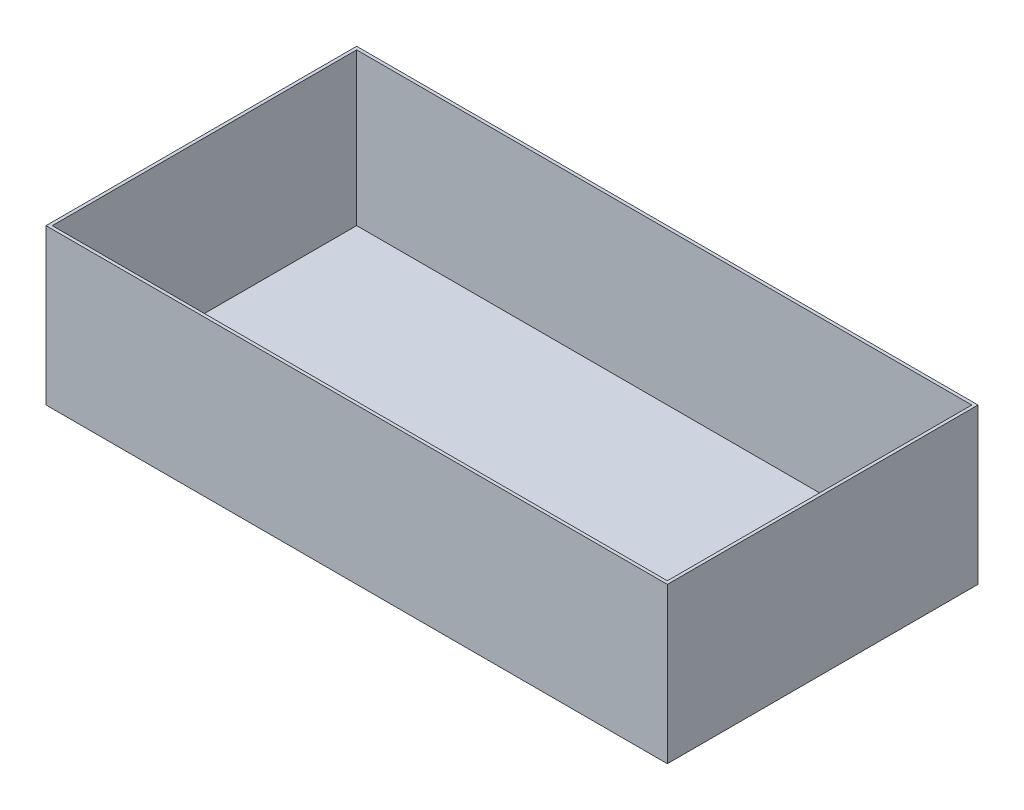
ISO-10303-21;
HEADER;
FILE_DESCRIPTION(('STEP AP214'),'2;1');
FILE_NAME('part.step','',(''),(''),'','','');
FILE_SCHEMA(('AUTOMOTIVE_DESIGN { 1 0 10303 214 1 1 1 1 }'));
ENDSEC;
DATA;
#1=APPLICATION_CONTEXT('core data for automotive mechanical design processes');
#2=APPLICATION_PROTOCOL_DEFINITION('international standard','automotive_design',2000,#1);
#3=PRODUCT_CONTEXT('',#1,'mechanical');
#4=PRODUCT('Part','Part','',(#3));
#5=PRODUCT_RELATED_PRODUCT_CATEGORY('part','',(#4));
#6=PRODUCT_DEFINITION_FORMATION('','',#4);
#7=PRODUCT_DEFINITION_CONTEXT('part definition',#1,'design');
#8=PRODUCT_DEFINITION('design','',#6,#7);
#9=PRODUCT_DEFINITION_SHAPE('','',#8);
#10=(LENGTH_UNIT() NAMED_UNIT(*) SI_UNIT(.MILLI.,.METRE.));
#11=(NAMED_UNIT(*) PLANE_ANGLE_UNIT() SI_UNIT($,.RADIAN.));
#12=(NAMED_UNIT(*) SI_UNIT($,.STERADIAN.) SOLID_ANGLE_UNIT());
#13=UNCERTAINTY_MEASURE_WITH_UNIT(LENGTH_MEASURE(1.E-05),#10,'distance_accuracy_value','');
#14=(GEOMETRIC_REPRESENTATION_CONTEXT(3) GLOBAL_UNCERTAINTY_ASSIGNED_CONTEXT((#13)) GLOBAL_UNIT_ASSIGNED_CONTEXT((#10,
#11,#12)) REPRESENTATION_CONTEXT('',''));
#15=CARTESIAN_POINT('',(0.,0.,0.));
#16=DIRECTION('',(0.,0.,1.));
#17=DIRECTION('',(1.,0.,0.));
#18=AXIS2_PLACEMENT_3D('',#15,#16,#17);
#19=CARTESIAN_POINT('',(-100.,50.,50.));
#20=DIRECTION('',(-1.,0.,0.));
#21=DIRECTION('',(0.,0.,1.));
#22=AXIS2_PLACEMENT_3D('',#19,#20,#21);
#23=PLANE('',#22);
#24=DIRECTION('',(0.,0.,-1.));
#25=VECTOR('',#24,1.);
#26=CARTESIAN_POINT('',(-100.,0.,50.));
#27=LINE('',#26,#25);
#28=CARTESIAN_POINT('',(-100.,0.,50.));
#29=VERTEX_POINT('',#28);
#30=CARTESIAN_POINT('',(-100.,0.,-50.));
#31=VERTEX_POINT('',#30);
#32=EDGE_CURVE('E139',#29,#31,#27,.T.);
#33=ORIENTED_EDGE('',*,*,#32,.F.);
#34=DIRECTION('',(0.,-1.,0.));
#35=VECTOR('',#34,1.);
#36=CARTESIAN_POINT('',(-100.,50.,50.));
#37=LINE('',#36,#35);
#38=CARTESIAN_POINT('',(-100.,50.,50.));
#39=VERTEX_POINT('',#38);
#40=EDGE_CURVE('E11',#39,#29,#37,.T.);
#41=ORIENTED_EDGE('',*,*,#40,.F.);
#42=DIRECTION('',(0.,0.,-1.));
#43=VECTOR('',#42,1.);
#44=CARTESIAN_POINT('',(-100.,50.,50.));
#45=LINE('',#44,#43);
#46=CARTESIAN_POINT('',(-100.,50.,-50.));
#47=VERTEX_POINT('',#46);
#48=EDGE_CURVE('E143',#39,#47,#45,.T.);
#49=ORIENTED_EDGE('',*,*,#48,.T.);
#50=DIRECTION('',(0.,-1.,0.));
#51=VECTOR('',#50,1.);
#52=CARTESIAN_POINT('',(-100.,50.,-50.));
#53=LINE('',#52,#51);
#54=EDGE_CURVE('E36',#47,#31,#53,.T.);
#55=ORIENTED_EDGE('',*,*,#54,.T.);
#56=EDGE_LOOP('',(#33,#41,#49,#55));
#57=FACE_BOUND('',#56,.T.);
#58=ADVANCED_FACE('F33',(#57),#23,.T.);
#59=CARTESIAN_POINT('',(-100.,50.,50.));
#60=DIRECTION('',(0.,0.,-1.));
#61=DIRECTION('',(-1.,0.,0.));
#62=AXIS2_PLACEMENT_3D('',#59,#60,#61);
#63=PLANE('',#62);
#64=DIRECTION('',(1.,0.,0.));
#65=VECTOR('',#64,1.);
#66=CARTESIAN_POINT('',(-100.,0.,50.));
#67=LINE('',#66,#65);
#68=CARTESIAN_POINT('',(100.,0.,50.));
#69=VERTEX_POINT('',#68);
#70=EDGE_CURVE('E146',#29,#69,#67,.T.);
#71=ORIENTED_EDGE('',*,*,#70,.T.);
#72=DIRECTION('',(0.,-1.,0.));
#73=VECTOR('',#72,1.);
#74=CARTESIAN_POINT('',(100.,50.,50.));
#75=LINE('',#74,#73);
#76=CARTESIAN_POINT('',(100.,50.,50.));
#77=VERTEX_POINT('',#76);
#78=EDGE_CURVE('E41',#77,#69,#75,.T.);
#79=ORIENTED_EDGE('',*,*,#78,.F.);
#80=DIRECTION('',(1.,0.,0.));
#81=VECTOR('',#80,1.);
#82=CARTESIAN_POINT('',(-100.,50.,50.));
#83=LINE('',#82,#81);
#84=EDGE_CURVE('E150',#39,#77,#83,.T.);
#85=ORIENTED_EDGE('',*,*,#84,.F.);
#86=ORIENTED_EDGE('',*,*,#40,.T.);
#87=EDGE_LOOP('',(#71,#79,#85,#86));
#88=FACE_BOUND('',#87,.T.);
#89=ADVANCED_FACE('F170',(#88),#63,.F.);
#90=CARTESIAN_POINT('',(100.,50.,50.));
#91=DIRECTION('',(-1.,0.,0.));
#92=DIRECTION('',(0.,0.,1.));
#93=AXIS2_PLACEMENT_3D('',#90,#91,#92);
#94=PLANE('',#93);
#95=DIRECTION('',(0.,0.,-1.));
#96=VECTOR('',#95,1.);
#97=CARTESIAN_POINT('',(100.,0.,50.));
#98=LINE('',#97,#96);
#99=CARTESIAN_POINT('',(100.,0.,-50.));
#100=VERTEX_POINT('',#99);
#101=EDGE_CURVE('E157',#69,#100,#98,.T.);
#102=ORIENTED_EDGE('',*,*,#101,.T.);
#103=DIRECTION('',(0.,-1.,0.));
#104=VECTOR('',#103,1.);
#105=CARTESIAN_POINT('',(100.,50.,-50.));
#106=LINE('',#105,#104);
#107=CARTESIAN_POINT('',(100.,50.,-50.));
#108=VERTEX_POINT('',#107);
#109=EDGE_CURVE('E162',#108,#100,#106,.T.);
#110=ORIENTED_EDGE('',*,*,#109,.F.);
#111=DIRECTION('',(0.,0.,-1.));
#112=VECTOR('',#111,1.);
#113=CARTESIAN_POINT('',(100.,50.,50.));
#114=LINE('',#113,#112);
#115=EDGE_CURVE('E148',#77,#108,#114,.T.);
#116=ORIENTED_EDGE('',*,*,#115,.F.);
#117=ORIENTED_EDGE('',*,*,#78,.T.);
#118=EDGE_LOOP('',(#102,#110,#116,#117));
#119=FACE_BOUND('',#118,.T.);
#120=ADVANCED_FACE('F173',(#119),#94,.F.);
#121=CARTESIAN_POINT('',(-100.,50.,-50.));
#122=DIRECTION('',(0.,0.,-1.));
#123=DIRECTION('',(-1.,0.,0.));
#124=AXIS2_PLACEMENT_3D('',#121,#122,#123);
#125=PLANE('',#124);
#126=DIRECTION('',(1.,0.,0.));
#127=VECTOR('',#126,1.);
#128=CARTESIAN_POINT('',(-100.,0.,-50.));
#129=LINE('',#128,#127);
#130=EDGE_CURVE('E154',#31,#100,#129,.T.);
#131=ORIENTED_EDGE('',*,*,#130,.F.);
#132=ORIENTED_EDGE('',*,*,#54,.F.);
#133=DIRECTION('',(1.,0.,0.));
#134=VECTOR('',#133,1.);
#135=CARTESIAN_POINT('',(-100.,50.,-50.));
#136=LINE('',#135,#134);
#137=EDGE_CURVE('E145',#47,#108,#136,.T.);
#138=ORIENTED_EDGE('',*,*,#137,.T.);
#139=ORIENTED_EDGE('',*,*,#109,.T.);
#140=EDGE_LOOP('',(#131,#132,#138,#139));
#141=FACE_BOUND('',#140,.T.);
#142=ADVANCED_FACE('F165',(#141),#125,.T.);
#143=CARTESIAN_POINT('',(0.,50.,0.));
#144=DIRECTION('',(0.,-1.,0.));
#145=DIRECTION('',(0.,0.,-1.));
#146=AXIS2_PLACEMENT_3D('',#143,#144,#145);
#147=PLANE('',#146);
#148=DIRECTION('',(-1.,0.,0.));
#149=VECTOR('',#148,1.);
#150=CARTESIAN_POINT('',(-99.,50.,-49.));
#151=LINE('',#150,#149);
#152=CARTESIAN_POINT('',(99.,50.,-49.));
#153=VERTEX_POINT('',#152);
#154=CARTESIAN_POINT('',(-99.,50.,-49.));
#155=VERTEX_POINT('',#154);
#156=EDGE_CURVE('E133',#153,#155,#151,.T.);
#157=ORIENTED_EDGE('',*,*,#156,.F.);
#158=DIRECTION('',(0.,0.,-1.));
#159=VECTOR('',#158,1.);
#160=CARTESIAN_POINT('',(99.,50.,49.));
#161=LINE('',#160,#159);
#162=CARTESIAN_POINT('',(99.,50.,49.));
#163=VERTEX_POINT('',#162);
#164=EDGE_CURVE('E49',#163,#153,#161,.T.);
#165=ORIENTED_EDGE('',*,*,#164,.F.);
#166=DIRECTION('',(1.,0.,0.));
#167=VECTOR('',#166,1.);
#168=CARTESIAN_POINT('',(-99.,50.,49.));
#169=LINE('',#168,#167);
#170=CARTESIAN_POINT('',(-99.,50.,49.));
#171=VERTEX_POINT('',#170);
#172=EDGE_CURVE('E124',#171,#163,#169,.T.);
#173=ORIENTED_EDGE('',*,*,#172,.F.);
#174=DIRECTION('',(0.,0.,1.));
#175=VECTOR('',#174,1.);
#176=CARTESIAN_POINT('',(-99.,50.,49.));
#177=LINE('',#176,#175);
#178=EDGE_CURVE('E127',#155,#171,#177,.T.);
#179=ORIENTED_EDGE('',*,*,#178,.F.);
#180=EDGE_LOOP('',(#157,#165,#173,#179));
#181=FACE_BOUND('',#180,.T.);
#182=ORIENTED_EDGE('',*,*,#48,.F.);
#183=ORIENTED_EDGE('',*,*,#84,.T.);
#184=ORIENTED_EDGE('',*,*,#115,.T.);
#185=ORIENTED_EDGE('',*,*,#137,.F.);
#186=EDGE_LOOP('',(#182,#183,#184,#185));
#187=FACE_BOUND('',#186,.T.);
#188=ADVANCED_FACE('F175',(#181,#187),#147,.F.);
#189=CARTESIAN_POINT('',(0.,0.,0.));
#190=DIRECTION('',(0.,-1.,0.));
#191=DIRECTION('',(0.,0.,-1.));
#192=AXIS2_PLACEMENT_3D('',#189,#190,#191);
#193=PLANE('',#192);
#194=ORIENTED_EDGE('',*,*,#32,.T.);
#195=ORIENTED_EDGE('',*,*,#130,.T.);
#196=ORIENTED_EDGE('',*,*,#101,.F.);
#197=ORIENTED_EDGE('',*,*,#70,.F.);
#198=EDGE_LOOP('',(#194,#195,#196,#197));
#199=FACE_BOUND('',#198,.T.);
#200=ADVANCED_FACE('F168',(#199),#193,.T.);
#201=CARTESIAN_POINT('',(99.,1.,49.));
#202=DIRECTION('',(1.,0.,0.));
#203=DIRECTION('',(0.,0.,-1.));
#204=AXIS2_PLACEMENT_3D('',#201,#202,#203);
#205=PLANE('',#204);
#206=ORIENTED_EDGE('',*,*,#164,.T.);
#207=DIRECTION('',(0.,1.,0.));
#208=VECTOR('',#207,1.);
#209=CARTESIAN_POINT('',(99.,1.,-49.));
#210=LINE('',#209,#208);
#211=CARTESIAN_POINT('',(99.,1.,-49.));
#212=VERTEX_POINT('',#211);
#213=EDGE_CURVE('E102',#212,#153,#210,.T.);
#214=ORIENTED_EDGE('',*,*,#213,.F.);
#215=DIRECTION('',(0.,0.,-1.));
#216=VECTOR('',#215,1.);
#217=CARTESIAN_POINT('',(99.,1.,49.));
#218=LINE('',#217,#216);
#219=CARTESIAN_POINT('',(99.,1.,49.));
#220=VERTEX_POINT('',#219);
#221=EDGE_CURVE('E106',#220,#212,#218,.T.);
#222=ORIENTED_EDGE('',*,*,#221,.F.);
#223=DIRECTION('',(0.,1.,0.));
#224=VECTOR('',#223,1.);
#225=CARTESIAN_POINT('',(99.,1.,49.));
#226=LINE('',#225,#224);
#227=EDGE_CURVE('E137',#220,#163,#226,.T.);
#228=ORIENTED_EDGE('',*,*,#227,.T.);
#229=EDGE_LOOP('',(#206,#214,#222,#228));
#230=FACE_BOUND('',#229,.T.);
#231=ADVANCED_FACE('F104',(#230),#205,.F.);
#232=CARTESIAN_POINT('',(-99.,1.,49.));
#233=DIRECTION('',(0.,0.,1.));
#234=DIRECTION('',(1.,0.,0.));
#235=AXIS2_PLACEMENT_3D('',#232,#233,#234);
#236=PLANE('',#235);
#237=ORIENTED_EDGE('',*,*,#172,.T.);
#238=ORIENTED_EDGE('',*,*,#227,.F.);
#239=DIRECTION('',(1.,0.,0.));
#240=VECTOR('',#239,1.);
#241=CARTESIAN_POINT('',(-99.,1.,49.));
#242=LINE('',#241,#240);
#243=CARTESIAN_POINT('',(-99.,1.,49.));
#244=VERTEX_POINT('',#243);
#245=EDGE_CURVE('E112',#244,#220,#242,.T.);
#246=ORIENTED_EDGE('',*,*,#245,.F.);
#247=DIRECTION('',(0.,1.,0.));
#248=VECTOR('',#247,1.);
#249=CARTESIAN_POINT('',(-99.,1.,49.));
#250=LINE('',#249,#248);
#251=EDGE_CURVE('E140',#244,#171,#250,.T.);
#252=ORIENTED_EDGE('',*,*,#251,.T.);
#253=EDGE_LOOP('',(#237,#238,#246,#252));
#254=FACE_BOUND('',#253,.T.);
#255=ADVANCED_FACE('F219',(#254),#236,.F.);
#256=CARTESIAN_POINT('',(-99.,1.,49.));
#257=DIRECTION('',(-1.,0.,0.));
#258=DIRECTION('',(0.,0.,1.));
#259=AXIS2_PLACEMENT_3D('',#256,#257,#258);
#260=PLANE('',#259);
#261=ORIENTED_EDGE('',*,*,#178,.T.);
#262=ORIENTED_EDGE('',*,*,#251,.F.);
#263=DIRECTION('',(0.,0.,1.));
#264=VECTOR('',#263,1.);
#265=CARTESIAN_POINT('',(-99.,1.,49.));
#266=LINE('',#265,#264);
#267=CARTESIAN_POINT('',(-99.,1.,-49.));
#268=VERTEX_POINT('',#267);
#269=EDGE_CURVE('E120',#268,#244,#266,.T.);
#270=ORIENTED_EDGE('',*,*,#269,.F.);
#271=DIRECTION('',(0.,1.,0.));
#272=VECTOR('',#271,1.);
#273=CARTESIAN_POINT('',(-99.,1.,-49.));
#274=LINE('',#273,#272);
#275=EDGE_CURVE('E111',#268,#155,#274,.T.);
#276=ORIENTED_EDGE('',*,*,#275,.T.);
#277=EDGE_LOOP('',(#261,#262,#270,#276));
#278=FACE_BOUND('',#277,.T.);
#279=ADVANCED_FACE('F227',(#278),#260,.F.);
#280=CARTESIAN_POINT('',(-99.,1.,-49.));
#281=DIRECTION('',(0.,0.,-1.));
#282=DIRECTION('',(-1.,0.,0.));
#283=AXIS2_PLACEMENT_3D('',#280,#281,#282);
#284=PLANE('',#283);
#285=ORIENTED_EDGE('',*,*,#156,.T.);
#286=ORIENTED_EDGE('',*,*,#275,.F.);
#287=DIRECTION('',(-1.,0.,0.));
#288=VECTOR('',#287,1.);
#289=CARTESIAN_POINT('',(-99.,1.,-49.));
#290=LINE('',#289,#288);
#291=EDGE_CURVE('E115',#212,#268,#290,.T.);
#292=ORIENTED_EDGE('',*,*,#291,.F.);
#293=ORIENTED_EDGE('',*,*,#213,.T.);
#294=EDGE_LOOP('',(#285,#286,#292,#293));
#295=FACE_BOUND('',#294,.T.);
#296=ADVANCED_FACE('F116',(#295),#284,.F.);
#297=CARTESIAN_POINT('',(0.,1.,0.));
#298=DIRECTION('',(0.,-1.,0.));
#299=DIRECTION('',(0.,0.,-1.));
#300=AXIS2_PLACEMENT_3D('',#297,#298,#299);
#301=PLANE('',#300);
#302=ORIENTED_EDGE('',*,*,#221,.T.);
#303=ORIENTED_EDGE('',*,*,#291,.T.);
#304=ORIENTED_EDGE('',*,*,#269,.T.);
#305=ORIENTED_EDGE('',*,*,#245,.T.);
#306=EDGE_LOOP('',(#302,#303,#304,#305));
#307=FACE_BOUND('',#306,.T.);
#308=ADVANCED_FACE('F122',(#307),#301,.F.);
#309=CLOSED_SHELL('',(#58,#89,#120,#142,#188,#200,#231,#255,#279,#296,#308));
#310=MANIFOLD_SOLID_BREP('B2',#309);
#311=ADVANCED_BREP_SHAPE_REPRESENTATION('',(#18,#310),#14);
#312=SHAPE_DEFINITION_REPRESENTATION(#9,#311);
ENDSEC;
END-ISO-10303-21;
